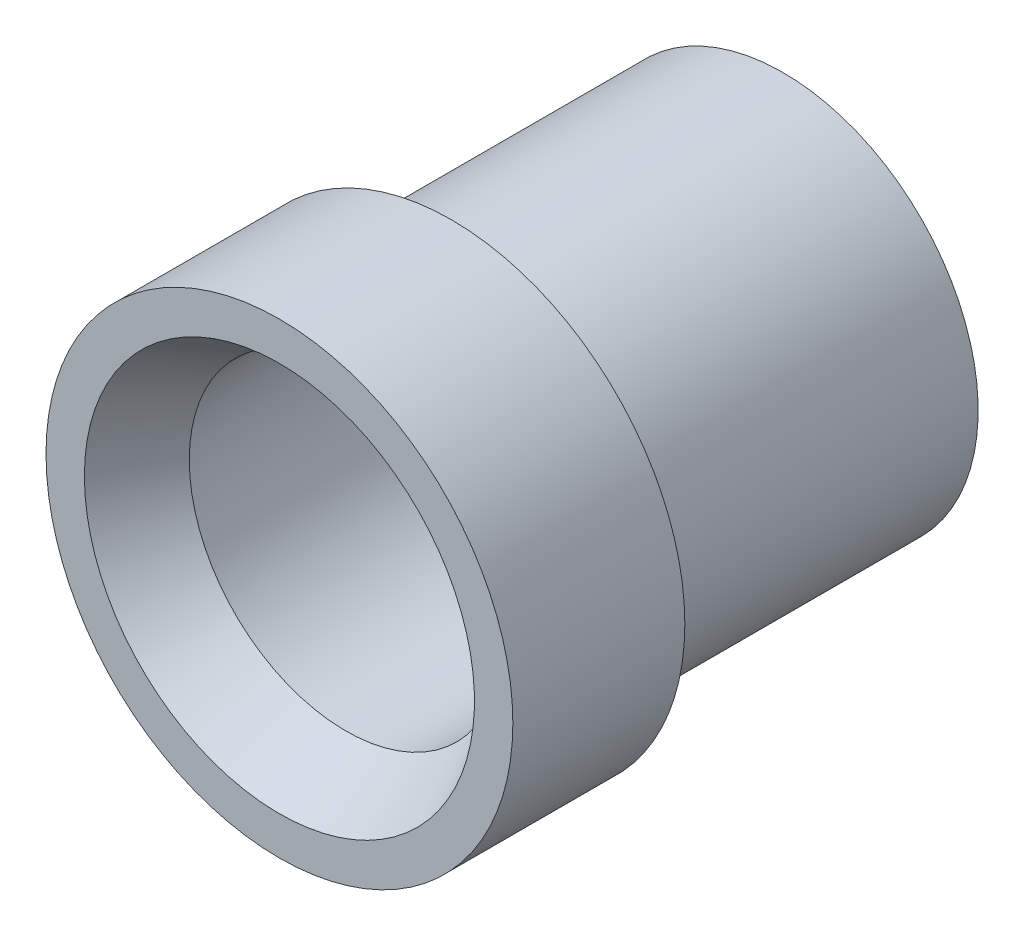
ISO-10303-21;
HEADER;
FILE_DESCRIPTION(('STEP AP214'),'2;1');
FILE_NAME('part.step','',(''),(''),'','','');
FILE_SCHEMA(('AUTOMOTIVE_DESIGN { 1 0 10303 214 1 1 1 1 }'));
ENDSEC;
DATA;
#1=APPLICATION_CONTEXT('core data for automotive mechanical design processes');
#2=APPLICATION_PROTOCOL_DEFINITION('international standard','automotive_design',2000,#1);
#3=PRODUCT_CONTEXT('',#1,'mechanical');
#4=PRODUCT('Part','Part','',(#3));
#5=PRODUCT_RELATED_PRODUCT_CATEGORY('part','',(#4));
#6=PRODUCT_DEFINITION_FORMATION('','',#4);
#7=PRODUCT_DEFINITION_CONTEXT('part definition',#1,'design');
#8=PRODUCT_DEFINITION('design','',#6,#7);
#9=PRODUCT_DEFINITION_SHAPE('','',#8);
#10=(LENGTH_UNIT() NAMED_UNIT(*) SI_UNIT(.MILLI.,.METRE.));
#11=(NAMED_UNIT(*) PLANE_ANGLE_UNIT() SI_UNIT($,.RADIAN.));
#12=(NAMED_UNIT(*) SI_UNIT($,.STERADIAN.) SOLID_ANGLE_UNIT());
#13=UNCERTAINTY_MEASURE_WITH_UNIT(LENGTH_MEASURE(1.E-05),#10,'distance_accuracy_value','');
#14=(GEOMETRIC_REPRESENTATION_CONTEXT(3) GLOBAL_UNCERTAINTY_ASSIGNED_CONTEXT((#13)) GLOBAL_UNIT_ASSIGNED_CONTEXT((#10,
#11,#12)) REPRESENTATION_CONTEXT('',''));
#15=CARTESIAN_POINT('',(0.,0.,0.));
#16=DIRECTION('',(0.,0.,1.));
#17=DIRECTION('',(1.,0.,0.));
#18=AXIS2_PLACEMENT_3D('',#15,#16,#17);
#19=CARTESIAN_POINT('',(0.,4.826,5.207));
#20=DIRECTION('',(0.,0.,1.));
#21=DIRECTION('',(1.,0.,0.));
#22=AXIS2_PLACEMENT_3D('',#19,#20,#21);
#23=PLANE('',#22);
#24=CARTESIAN_POINT('',(0.,0.,5.207));
#25=DIRECTION('',(0.,0.,-1.));
#26=DIRECTION('',(-1.,0.,0.));
#27=AXIS2_PLACEMENT_3D('',#24,#25,#26);
#28=CIRCLE('',#27,4.03225);
#29=CARTESIAN_POINT('',(-4.03225,0.,5.207));
#30=VERTEX_POINT('',#29);
#31=EDGE_CURVE('E10',#30,#30,#28,.T.);
#32=ORIENTED_EDGE('',*,*,#31,.T.);
#33=EDGE_LOOP('',(#32));
#34=FACE_BOUND('',#33,.T.);
#35=CARTESIAN_POINT('',(0.,0.,5.207));
#36=DIRECTION('',(0.,0.,-1.));
#37=DIRECTION('',(-1.,0.,0.));
#38=AXIS2_PLACEMENT_3D('',#35,#36,#37);
#39=CIRCLE('',#38,4.826);
#40=CARTESIAN_POINT('',(-4.826,0.,5.207));
#41=VERTEX_POINT('',#40);
#42=EDGE_CURVE('E56',#41,#41,#39,.T.);
#43=ORIENTED_EDGE('',*,*,#42,.F.);
#44=EDGE_LOOP('',(#43));
#45=FACE_BOUND('',#44,.T.);
#46=ADVANCED_FACE('F31',(#34,#45),#23,.T.);
#47=CARTESIAN_POINT('',(0.,0.,5.207));
#48=DIRECTION('',(0.,0.,1.));
#49=DIRECTION('',(1.,0.,0.));
#50=AXIS2_PLACEMENT_3D('',#47,#48,#49);
#51=CONICAL_SURFACE('',#50,4.03225,0.5235987755983);
#52=CARTESIAN_POINT('',(0.,0.,3.8321846714922));
#53=DIRECTION('',(0.,0.,-1.));
#54=DIRECTION('',(-1.,0.,0.));
#55=AXIS2_PLACEMENT_3D('',#52,#53,#54);
#56=CIRCLE('',#55,3.2385);
#57=CARTESIAN_POINT('',(-3.2385,0.,3.8321846714922));
#58=VERTEX_POINT('',#57);
#59=EDGE_CURVE('E37',#58,#58,#56,.T.);
#60=ORIENTED_EDGE('',*,*,#59,.T.);
#61=EDGE_LOOP('',(#60));
#62=FACE_BOUND('',#61,.T.);
#63=ORIENTED_EDGE('',*,*,#31,.F.);
#64=EDGE_LOOP('',(#63));
#65=FACE_BOUND('',#64,.T.);
#66=ADVANCED_FACE('F64',(#62,#65),#51,.F.);
#67=CARTESIAN_POINT('',(0.,0.,-5.207));
#68=DIRECTION('',(0.,0.,-1.));
#69=DIRECTION('',(-1.,0.,0.));
#70=AXIS2_PLACEMENT_3D('',#67,#68,#69);
#71=CYLINDRICAL_SURFACE('',#70,3.2385);
#72=CARTESIAN_POINT('',(0.,0.,-5.207));
#73=DIRECTION('',(0.,0.,-1.));
#74=DIRECTION('',(-1.,0.,0.));
#75=AXIS2_PLACEMENT_3D('',#72,#73,#74);
#76=CIRCLE('',#75,3.2385);
#77=CARTESIAN_POINT('',(-3.2385,0.,-5.207));
#78=VERTEX_POINT('',#77);
#79=EDGE_CURVE('E41',#78,#78,#76,.T.);
#80=ORIENTED_EDGE('',*,*,#79,.T.);
#81=EDGE_LOOP('',(#80));
#82=FACE_BOUND('',#81,.T.);
#83=ORIENTED_EDGE('',*,*,#59,.F.);
#84=EDGE_LOOP('',(#83));
#85=FACE_BOUND('',#84,.T.);
#86=ADVANCED_FACE('F68',(#82,#85),#71,.F.);
#87=CARTESIAN_POINT('',(0.,3.2385,-5.207));
#88=DIRECTION('',(0.,0.,-1.));
#89=DIRECTION('',(-1.,0.,0.));
#90=AXIS2_PLACEMENT_3D('',#87,#88,#89);
#91=PLANE('',#90);
#92=CARTESIAN_POINT('',(0.,0.,-5.207));
#93=DIRECTION('',(0.,0.,-1.));
#94=DIRECTION('',(-1.,0.,0.));
#95=AXIS2_PLACEMENT_3D('',#92,#93,#94);
#96=CIRCLE('',#95,4.03225);
#97=CARTESIAN_POINT('',(-4.03225,0.,-5.207));
#98=VERTEX_POINT('',#97);
#99=EDGE_CURVE('E45',#98,#98,#96,.T.);
#100=ORIENTED_EDGE('',*,*,#99,.T.);
#101=EDGE_LOOP('',(#100));
#102=FACE_BOUND('',#101,.T.);
#103=ORIENTED_EDGE('',*,*,#79,.F.);
#104=EDGE_LOOP('',(#103));
#105=FACE_BOUND('',#104,.T.);
#106=ADVANCED_FACE('F72',(#102,#105),#91,.T.);
#107=CARTESIAN_POINT('',(0.,0.,-5.207));
#108=DIRECTION('',(0.,0.,-1.));
#109=DIRECTION('',(-1.,0.,0.));
#110=AXIS2_PLACEMENT_3D('',#107,#108,#109);
#111=CYLINDRICAL_SURFACE('',#110,4.03225);
#112=CARTESIAN_POINT('',(0.,0.,1.651));
#113=DIRECTION('',(0.,0.,-1.));
#114=DIRECTION('',(-1.,0.,0.));
#115=AXIS2_PLACEMENT_3D('',#112,#113,#114);
#116=CIRCLE('',#115,4.03225);
#117=CARTESIAN_POINT('',(-4.03225,0.,1.651));
#118=VERTEX_POINT('',#117);
#119=EDGE_CURVE('E50',#118,#118,#116,.T.);
#120=ORIENTED_EDGE('',*,*,#119,.T.);
#121=EDGE_LOOP('',(#120));
#122=FACE_BOUND('',#121,.T.);
#123=ORIENTED_EDGE('',*,*,#99,.F.);
#124=EDGE_LOOP('',(#123));
#125=FACE_BOUND('',#124,.T.);
#126=ADVANCED_FACE('F79',(#122,#125),#111,.T.);
#127=CARTESIAN_POINT('',(0.,4.03225,1.651));
#128=DIRECTION('',(0.,0.,-1.));
#129=DIRECTION('',(-1.,0.,0.));
#130=AXIS2_PLACEMENT_3D('',#127,#128,#129);
#131=PLANE('',#130);
#132=CARTESIAN_POINT('',(0.,0.,1.651));
#133=DIRECTION('',(0.,0.,-1.));
#134=DIRECTION('',(-1.,0.,0.));
#135=AXIS2_PLACEMENT_3D('',#132,#133,#134);
#136=CIRCLE('',#135,4.826);
#137=CARTESIAN_POINT('',(-4.826,0.,1.651));
#138=VERTEX_POINT('',#137);
#139=EDGE_CURVE('E53',#138,#138,#136,.T.);
#140=ORIENTED_EDGE('',*,*,#139,.T.);
#141=EDGE_LOOP('',(#140));
#142=FACE_BOUND('',#141,.T.);
#143=ORIENTED_EDGE('',*,*,#119,.F.);
#144=EDGE_LOOP('',(#143));
#145=FACE_BOUND('',#144,.T.);
#146=ADVANCED_FACE('F83',(#142,#145),#131,.T.);
#147=CARTESIAN_POINT('',(0.,0.,-5.207));
#148=DIRECTION('',(0.,0.,-1.));
#149=DIRECTION('',(-1.,0.,0.));
#150=AXIS2_PLACEMENT_3D('',#147,#148,#149);
#151=CYLINDRICAL_SURFACE('',#150,4.826);
#152=ORIENTED_EDGE('',*,*,#42,.T.);
#153=EDGE_LOOP('',(#152));
#154=FACE_BOUND('',#153,.T.);
#155=ORIENTED_EDGE('',*,*,#139,.F.);
#156=EDGE_LOOP('',(#155));
#157=FACE_BOUND('',#156,.T.);
#158=ADVANCED_FACE('F60',(#154,#157),#151,.T.);
#159=CLOSED_SHELL('',(#46,#66,#86,#106,#126,#146,#158));
#160=MANIFOLD_SOLID_BREP('B2',#159);
#161=ADVANCED_BREP_SHAPE_REPRESENTATION('',(#18,#160),#14);
#162=SHAPE_DEFINITION_REPRESENTATION(#9,#161);
ENDSEC;
END-ISO-10303-21;
